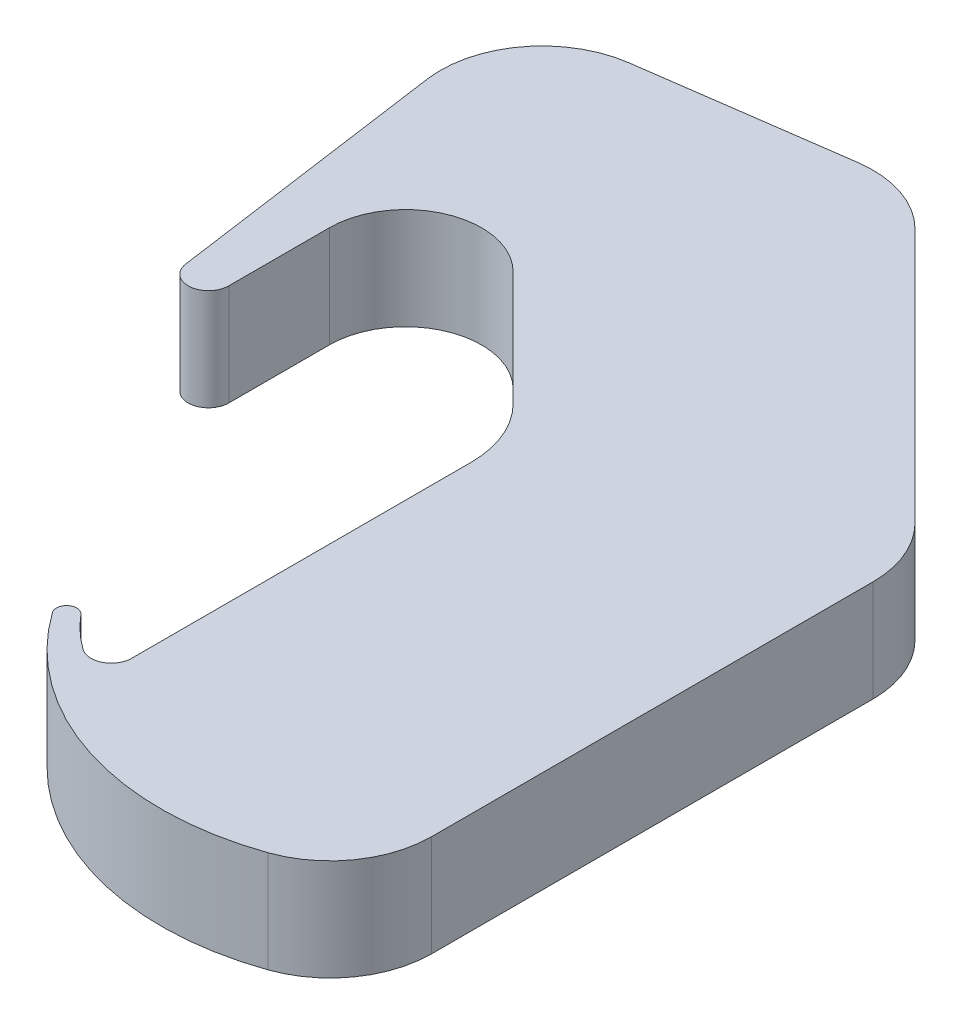
ISO-10303-21;
HEADER;
FILE_DESCRIPTION(('STEP AP214'),'2;1');
FILE_NAME('part.step','',(''),(''),'','','');
FILE_SCHEMA(('AUTOMOTIVE_DESIGN { 1 0 10303 214 1 1 1 1 }'));
ENDSEC;
DATA;
#1=APPLICATION_CONTEXT('core data for automotive mechanical design processes');
#2=APPLICATION_PROTOCOL_DEFINITION('international standard','automotive_design',2000,#1);
#3=PRODUCT_CONTEXT('',#1,'mechanical');
#4=PRODUCT('Part','Part','',(#3));
#5=PRODUCT_RELATED_PRODUCT_CATEGORY('part','',(#4));
#6=PRODUCT_DEFINITION_FORMATION('','',#4);
#7=PRODUCT_DEFINITION_CONTEXT('part definition',#1,'design');
#8=PRODUCT_DEFINITION('design','',#6,#7);
#9=PRODUCT_DEFINITION_SHAPE('','',#8);
#10=(LENGTH_UNIT() NAMED_UNIT(*) SI_UNIT(.MILLI.,.METRE.));
#11=(NAMED_UNIT(*) PLANE_ANGLE_UNIT() SI_UNIT($,.RADIAN.));
#12=(NAMED_UNIT(*) SI_UNIT($,.STERADIAN.) SOLID_ANGLE_UNIT());
#13=UNCERTAINTY_MEASURE_WITH_UNIT(LENGTH_MEASURE(1.E-05),#10,'distance_accuracy_value','');
#14=(GEOMETRIC_REPRESENTATION_CONTEXT(3) GLOBAL_UNCERTAINTY_ASSIGNED_CONTEXT((#13)) GLOBAL_UNIT_ASSIGNED_CONTEXT((#10,
#11,#12)) REPRESENTATION_CONTEXT('',''));
#15=CARTESIAN_POINT('',(0.,0.,0.));
#16=DIRECTION('',(0.,0.,1.));
#17=DIRECTION('',(1.,0.,0.));
#18=AXIS2_PLACEMENT_3D('',#15,#16,#17);
#19=CARTESIAN_POINT('',(3.93125032785003,10.,-3.93125032785006));
#20=DIRECTION('',(-0.707106781186545,0.,0.70710678118655));
#21=DIRECTION('',(0.70710678118655,0.,0.707106781186545));
#22=AXIS2_PLACEMENT_3D('',#19,#20,#21);
#23=PLANE('',#22);
#24=DIRECTION('',(-0.70710678118655,0.,-0.707106781186545));
#25=VECTOR('',#24,1.);
#26=CARTESIAN_POINT('',(3.93125032785003,0.,-3.93125032785006));
#27=LINE('',#26,#25);
#28=CARTESIAN_POINT('',(-28.5248358170459,0.,-36.3873364727457));
#29=VERTEX_POINT('',#28);
#30=CARTESIAN_POINT('',(-53.6653003749161,0.,-61.5278010306157));
#31=VERTEX_POINT('',#30);
#32=EDGE_CURVE('E229',#29,#31,#27,.T.);
#33=ORIENTED_EDGE('',*,*,#32,.T.);
#34=DIRECTION('',(0.,-1.,0.));
#35=VECTOR('',#34,1.);
#36=CARTESIAN_POINT('',(-53.6653003749161,10.,-61.5278010306157));
#37=LINE('',#36,#35);
#38=CARTESIAN_POINT('',(-53.6653003749161,10.,-61.5278010306157));
#39=VERTEX_POINT('',#38);
#40=EDGE_CURVE('E332',#31,#39,#37,.F.);
#41=ORIENTED_EDGE('',*,*,#40,.T.);
#42=DIRECTION('',(-0.70710678118655,0.,-0.707106781186545));
#43=VECTOR('',#42,1.);
#44=CARTESIAN_POINT('',(3.93125032785003,10.,-3.93125032785006));
#45=LINE('',#44,#43);
#46=CARTESIAN_POINT('',(-28.5248358170459,10.,-36.3873364727457));
#47=VERTEX_POINT('',#46);
#48=EDGE_CURVE('E271',#47,#39,#45,.T.);
#49=ORIENTED_EDGE('',*,*,#48,.F.);
#50=DIRECTION('',(0.,-1.,0.));
#51=VECTOR('',#50,1.);
#52=CARTESIAN_POINT('',(-28.5248358170459,0.,-36.3873364727457));
#53=LINE('',#52,#51);
#54=EDGE_CURVE('E328',#47,#29,#53,.T.);
#55=ORIENTED_EDGE('',*,*,#54,.T.);
#56=EDGE_LOOP('',(#33,#41,#49,#55));
#57=FACE_BOUND('',#56,.T.);
#58=ADVANCED_FACE('F41',(#57),#23,.F.);
#59=CARTESIAN_POINT('',(-10.0423160386926,10.,-71.658758244364));
#60=DIRECTION('',(0.138784604687081,0.,0.990322590624818));
#61=DIRECTION('',(0.990322590624818,0.,-0.138784604687081));
#62=AXIS2_PLACEMENT_3D('',#59,#60,#61);
#63=PLANE('',#62);
#64=DIRECTION('',(-0.990322590624818,0.,0.138784604687081));
#65=VECTOR('',#64,1.);
#66=CARTESIAN_POINT('',(-10.0423160386926,0.,-71.658758244364));
#67=LINE('',#66,#65);
#68=CARTESIAN_POINT('',(-62.1242142336523,0.,-64.3599591249984));
#69=VERTEX_POINT('',#68);
#70=CARTESIAN_POINT('',(-81.9471378820217,0.,-61.5819586549239));
#71=VERTEX_POINT('',#70);
#72=EDGE_CURVE('E233',#69,#71,#67,.T.);
#73=ORIENTED_EDGE('',*,*,#72,.T.);
#74=DIRECTION('',(0.,-1.,0.));
#75=VECTOR('',#74,1.);
#76=CARTESIAN_POINT('',(-81.9471378820217,10.,-61.5819586549239));
#77=LINE('',#76,#75);
#78=CARTESIAN_POINT('',(-81.9471378820217,10.,-61.5819586549239));
#79=VERTEX_POINT('',#78);
#80=EDGE_CURVE('E304',#71,#79,#77,.F.);
#81=ORIENTED_EDGE('',*,*,#80,.T.);
#82=DIRECTION('',(-0.990322590624818,0.,0.138784604687081));
#83=VECTOR('',#82,1.);
#84=CARTESIAN_POINT('',(-10.0423160386926,10.,-71.658758244364));
#85=LINE('',#84,#83);
#86=CARTESIAN_POINT('',(-62.1242142336523,10.,-64.3599591249984));
#87=VERTEX_POINT('',#86);
#88=EDGE_CURVE('E179',#87,#79,#85,.T.);
#89=ORIENTED_EDGE('',*,*,#88,.F.);
#90=DIRECTION('',(0.,-1.,0.));
#91=VECTOR('',#90,1.);
#92=CARTESIAN_POINT('',(-62.1242142336523,10.,-64.3599591249984));
#93=LINE('',#92,#91);
#94=EDGE_CURVE('E300',#87,#69,#93,.T.);
#95=ORIENTED_EDGE('',*,*,#94,.T.);
#96=EDGE_LOOP('',(#73,#81,#89,#95));
#97=FACE_BOUND('',#96,.T.);
#98=ADVANCED_FACE('F424',(#97),#63,.F.);
#99=CARTESIAN_POINT('',(-81.8080477495774,10.,11.4646456363109));
#100=DIRECTION('',(0.990322590624818,0.,-0.138784604687081));
#101=DIRECTION('',(-0.138784604687081,0.,-0.990322590624818));
#102=AXIS2_PLACEMENT_3D('',#99,#100,#101);
#103=PLANE('',#102);
#104=DIRECTION('',(0.138784604687081,0.,0.990322590624818));
#105=VECTOR('',#104,1.);
#106=CARTESIAN_POINT('',(-81.8080477495774,10.,11.4646456363109));
#107=LINE('',#106,#105);
#108=CARTESIAN_POINT('',(-90.4625177413991,10.,-50.2908867018049));
#109=VERTEX_POINT('',#108);
#110=CARTESIAN_POINT('',(-86.5765488101609,10.,-22.56185416431));
#111=VERTEX_POINT('',#110);
#112=EDGE_CURVE('E166',#109,#111,#107,.T.);
#113=ORIENTED_EDGE('',*,*,#112,.F.);
#114=DIRECTION('',(0.,-1.,0.));
#115=VECTOR('',#114,1.);
#116=CARTESIAN_POINT('',(-90.4625177413991,10.,-50.2908867018049));
#117=LINE('',#116,#115);
#118=CARTESIAN_POINT('',(-90.4625177413991,0.,-50.2908867018049));
#119=VERTEX_POINT('',#118);
#120=EDGE_CURVE('E189',#109,#119,#117,.T.);
#121=ORIENTED_EDGE('',*,*,#120,.T.);
#122=DIRECTION('',(0.138784604687081,0.,0.990322590624818));
#123=VECTOR('',#122,1.);
#124=CARTESIAN_POINT('',(-81.8080477495774,0.,11.4646456363109));
#125=LINE('',#124,#123);
#126=CARTESIAN_POINT('',(-86.5765488101609,0.,-22.56185416431));
#127=VERTEX_POINT('',#126);
#128=EDGE_CURVE('E185',#119,#127,#125,.T.);
#129=ORIENTED_EDGE('',*,*,#128,.T.);
#130=DIRECTION('',(0.,-1.,0.));
#131=VECTOR('',#130,1.);
#132=CARTESIAN_POINT('',(-86.5765488101609,10.,-22.56185416431));
#133=LINE('',#132,#131);
#134=EDGE_CURVE('E182',#111,#127,#133,.T.);
#135=ORIENTED_EDGE('',*,*,#134,.F.);
#136=EDGE_LOOP('',(#113,#121,#129,#135));
#137=FACE_BOUND('',#136,.T.);
#138=ADVANCED_FACE('F183',(#137),#103,.F.);
#139=CARTESIAN_POINT('',(-84.5959036289112,10.,-22.8394233736842));
#140=DIRECTION('',(0.,-1.,0.));
#141=DIRECTION('',(0.,0.,-1.));
#142=AXIS2_PLACEMENT_3D('',#139,#140,#141);
#143=CYLINDRICAL_SURFACE('',#142,2.);
#144=CARTESIAN_POINT('',(-84.5959036289112,0.,-22.8394233736842));
#145=DIRECTION('',(0.,1.,0.));
#146=DIRECTION('',(0.,0.,1.));
#147=AXIS2_PLACEMENT_3D('',#144,#145,#146);
#148=CIRCLE('',#147,2.);
#149=CARTESIAN_POINT('',(-82.5959036289113,0.,-22.8394233736842));
#150=VERTEX_POINT('',#149);
#151=EDGE_CURVE('E239',#127,#150,#148,.T.);
#152=ORIENTED_EDGE('',*,*,#151,.T.);
#153=DIRECTION('',(0.,-1.,0.));
#154=VECTOR('',#153,1.);
#155=CARTESIAN_POINT('',(-82.5959036289113,10.,-22.8394233736842));
#156=LINE('',#155,#154);
#157=CARTESIAN_POINT('',(-82.5959036289113,10.,-22.8394233736842));
#158=VERTEX_POINT('',#157);
#159=EDGE_CURVE('E190',#158,#150,#156,.T.);
#160=ORIENTED_EDGE('',*,*,#159,.F.);
#161=CARTESIAN_POINT('',(-84.5959036289112,10.,-22.8394233736842));
#162=DIRECTION('',(0.,1.,0.));
#163=DIRECTION('',(0.,0.,1.));
#164=AXIS2_PLACEMENT_3D('',#161,#162,#163);
#165=CIRCLE('',#164,2.);
#166=EDGE_CURVE('E171',#111,#158,#165,.T.);
#167=ORIENTED_EDGE('',*,*,#166,.F.);
#168=ORIENTED_EDGE('',*,*,#134,.T.);
#169=EDGE_LOOP('',(#152,#160,#167,#168));
#170=FACE_BOUND('',#169,.T.);
#171=ADVANCED_FACE('F192',(#170),#143,.T.);
#172=CARTESIAN_POINT('',(-82.5959036289113,10.,0.));
#173=DIRECTION('',(-1.,0.,0.));
#174=DIRECTION('',(0.,0.,1.));
#175=AXIS2_PLACEMENT_3D('',#172,#173,#174);
#176=PLANE('',#175);
#177=DIRECTION('',(0.,0.,-1.));
#178=VECTOR('',#177,1.);
#179=CARTESIAN_POINT('',(-82.5959036289113,0.,0.));
#180=LINE('',#179,#178);
#181=CARTESIAN_POINT('',(-82.5959036289113,0.,-32.7538228203661));
#182=VERTEX_POINT('',#181);
#183=EDGE_CURVE('E242',#150,#182,#180,.T.);
#184=ORIENTED_EDGE('',*,*,#183,.T.);
#185=DIRECTION('',(0.,-1.,0.));
#186=VECTOR('',#185,1.);
#187=CARTESIAN_POINT('',(-82.5959036289113,10.,-32.7538228203661));
#188=LINE('',#187,#186);
#189=CARTESIAN_POINT('',(-82.5959036289113,10.,-32.7538228203661));
#190=VERTEX_POINT('',#189);
#191=EDGE_CURVE('E281',#190,#182,#188,.T.);
#192=ORIENTED_EDGE('',*,*,#191,.F.);
#193=DIRECTION('',(0.,0.,-1.));
#194=VECTOR('',#193,1.);
#195=CARTESIAN_POINT('',(-82.5959036289113,10.,0.));
#196=LINE('',#195,#194);
#197=EDGE_CURVE('E196',#158,#190,#196,.T.);
#198=ORIENTED_EDGE('',*,*,#197,.F.);
#199=ORIENTED_EDGE('',*,*,#159,.T.);
#200=EDGE_LOOP('',(#184,#192,#198,#199));
#201=FACE_BOUND('',#200,.T.);
#202=ADVANCED_FACE('F403',(#201),#176,.F.);
#203=CARTESIAN_POINT('',(-75.0959036289113,10.,-32.7538228203661));
#204=DIRECTION('',(0.,-1.,0.));
#205=DIRECTION('',(0.,0.,-1.));
#206=AXIS2_PLACEMENT_3D('',#203,#204,#205);
#207=CYLINDRICAL_SURFACE('',#206,7.50000000000003);
#208=CARTESIAN_POINT('',(-75.0959036289113,0.,-32.7538228203661));
#209=DIRECTION('',(0.,1.,0.));
#210=DIRECTION('',(0.,0.,1.));
#211=AXIS2_PLACEMENT_3D('',#208,#209,#210);
#212=CIRCLE('',#211,7.50000000000003);
#213=CARTESIAN_POINT('',(-69.7926027700122,0.,-38.0571236792652));
#214=VERTEX_POINT('',#213);
#215=EDGE_CURVE('E246',#214,#182,#212,.T.);
#216=ORIENTED_EDGE('',*,*,#215,.F.);
#217=DIRECTION('',(0.,-1.,0.));
#218=VECTOR('',#217,1.);
#219=CARTESIAN_POINT('',(-69.7926027700122,10.,-38.0571236792652));
#220=LINE('',#219,#218);
#221=CARTESIAN_POINT('',(-69.7926027700122,10.,-38.0571236792652));
#222=VERTEX_POINT('',#221);
#223=EDGE_CURVE('E278',#222,#214,#220,.T.);
#224=ORIENTED_EDGE('',*,*,#223,.F.);
#225=CARTESIAN_POINT('',(-75.0959036289113,10.,-32.7538228203661));
#226=DIRECTION('',(0.,1.,0.));
#227=DIRECTION('',(0.,0.,1.));
#228=AXIS2_PLACEMENT_3D('',#225,#226,#227);
#229=CIRCLE('',#228,7.50000000000003);
#230=EDGE_CURVE('E199',#222,#190,#229,.T.);
#231=ORIENTED_EDGE('',*,*,#230,.T.);
#232=ORIENTED_EDGE('',*,*,#191,.T.);
#233=EDGE_LOOP('',(#216,#224,#231,#232));
#234=FACE_BOUND('',#233,.T.);
#235=ADVANCED_FACE('F410',(#234),#207,.F.);
#236=CARTESIAN_POINT('',(-15.8677395453734,10.,15.8677395453734));
#237=DIRECTION('',(0.707106781186546,0.,-0.707106781186549));
#238=DIRECTION('',(-0.707106781186549,0.,-0.707106781186546));
#239=AXIS2_PLACEMENT_3D('',#236,#237,#238);
#240=PLANE('',#239);
#241=DIRECTION('',(0.707106781186549,0.,0.707106781186546));
#242=VECTOR('',#241,1.);
#243=CARTESIAN_POINT('',(-15.8677395453734,0.,15.8677395453734));
#244=LINE('',#243,#242);
#245=CARTESIAN_POINT('',(-58.5248358170458,0.,-26.7893567262989));
#246=VERTEX_POINT('',#245);
#247=EDGE_CURVE('E250',#214,#246,#244,.T.);
#248=ORIENTED_EDGE('',*,*,#247,.T.);
#249=DIRECTION('',(0.,-1.,0.));
#250=VECTOR('',#249,1.);
#251=CARTESIAN_POINT('',(-58.5248358170458,10.,-26.7893567262989));
#252=LINE('',#251,#250);
#253=CARTESIAN_POINT('',(-58.5248358170458,10.,-26.7893567262989));
#254=VERTEX_POINT('',#253);
#255=EDGE_CURVE('E339',#246,#254,#252,.F.);
#256=ORIENTED_EDGE('',*,*,#255,.T.);
#257=DIRECTION('',(0.707106781186549,0.,0.707106781186546));
#258=VECTOR('',#257,1.);
#259=CARTESIAN_POINT('',(-15.8677395453734,10.,15.8677395453734));
#260=LINE('',#259,#258);
#261=EDGE_CURVE('E206',#222,#254,#260,.T.);
#262=ORIENTED_EDGE('',*,*,#261,.F.);
#263=ORIENTED_EDGE('',*,*,#223,.T.);
#264=EDGE_LOOP('',(#248,#256,#262,#263));
#265=FACE_BOUND('',#264,.T.);
#266=ADVANCED_FACE('F413',(#265),#240,.F.);
#267=CARTESIAN_POINT('',(-55.5959036289113,10.,0.));
#268=DIRECTION('',(1.,0.,0.));
#269=DIRECTION('',(0.,0.,-1.));
#270=AXIS2_PLACEMENT_3D('',#267,#268,#269);
#271=PLANE('',#270);
#272=DIRECTION('',(0.,0.,1.));
#273=VECTOR('',#272,1.);
#274=CARTESIAN_POINT('',(-55.5959036289113,0.,0.));
#275=LINE('',#274,#273);
#276=CARTESIAN_POINT('',(-55.5959036289113,0.,-19.7182889144334));
#277=VERTEX_POINT('',#276);
#278=CARTESIAN_POINT('',(-55.5959036289113,0.,13.7337707016264));
#279=VERTEX_POINT('',#278);
#280=EDGE_CURVE('E254',#277,#279,#275,.T.);
#281=ORIENTED_EDGE('',*,*,#280,.T.);
#282=DIRECTION('',(0.,-1.,0.));
#283=VECTOR('',#282,1.);
#284=CARTESIAN_POINT('',(-55.5959036289113,10.,13.7337707016264));
#285=LINE('',#284,#283);
#286=CARTESIAN_POINT('',(-55.5959036289113,10.,13.7337707016264));
#287=VERTEX_POINT('',#286);
#288=EDGE_CURVE('E63',#279,#287,#285,.F.);
#289=ORIENTED_EDGE('',*,*,#288,.T.);
#290=DIRECTION('',(0.,0.,1.));
#291=VECTOR('',#290,1.);
#292=CARTESIAN_POINT('',(-55.5959036289113,10.,0.));
#293=LINE('',#292,#291);
#294=CARTESIAN_POINT('',(-55.5959036289113,10.,-19.7182889144334));
#295=VERTEX_POINT('',#294);
#296=EDGE_CURVE('E210',#295,#287,#293,.T.);
#297=ORIENTED_EDGE('',*,*,#296,.F.);
#298=DIRECTION('',(0.,-1.,0.));
#299=VECTOR('',#298,1.);
#300=CARTESIAN_POINT('',(-55.5959036289113,0.,-19.7182889144334));
#301=LINE('',#300,#299);
#302=EDGE_CURVE('E335',#295,#277,#301,.T.);
#303=ORIENTED_EDGE('',*,*,#302,.T.);
#304=EDGE_LOOP('',(#281,#289,#297,#303));
#305=FACE_BOUND('',#304,.T.);
#306=ADVANCED_FACE('F418',(#305),#271,.F.);
#307=CARTESIAN_POINT('',(-49.1558895883084,10.,1.98589000818354));
#308=DIRECTION('',(0.,-1.,0.));
#309=DIRECTION('',(0.,0.,-1.));
#310=AXIS2_PLACEMENT_3D('',#307,#308,#309);
#311=CYLINDRICAL_SURFACE('',#310,16.4653564696119);
#312=CARTESIAN_POINT('',(-49.1558895883084,10.,1.98589000818354));
#313=DIRECTION('',(0.,1.,0.));
#314=DIRECTION('',(0.,0.,1.));
#315=AXIS2_PLACEMENT_3D('',#312,#313,#314);
#316=CIRCLE('',#315,16.4653564696119);
#317=CARTESIAN_POINT('',(-61.8263794532103,10.,12.500957780424));
#318=VERTEX_POINT('',#317);
#319=CARTESIAN_POINT('',(-58.7628315312182,10.,15.3580487784401));
#320=VERTEX_POINT('',#319);
#321=EDGE_CURVE('E213',#318,#320,#316,.T.);
#322=ORIENTED_EDGE('',*,*,#321,.T.);
#323=DIRECTION('',(0.,-1.,0.));
#324=VECTOR('',#323,1.);
#325=CARTESIAN_POINT('',(-58.7628315312182,10.,15.3580487784401));
#326=LINE('',#325,#324);
#327=CARTESIAN_POINT('',(-58.7628315312182,0.,15.3580487784401));
#328=VERTEX_POINT('',#327);
#329=EDGE_CURVE('E348',#320,#328,#326,.T.);
#330=ORIENTED_EDGE('',*,*,#329,.T.);
#331=CARTESIAN_POINT('',(-49.1558895883084,0.,1.98589000818354));
#332=DIRECTION('',(0.,1.,0.));
#333=DIRECTION('',(0.,0.,1.));
#334=AXIS2_PLACEMENT_3D('',#331,#332,#333);
#335=CIRCLE('',#334,16.4653564696119);
#336=CARTESIAN_POINT('',(-61.8263794532103,0.,12.500957780424));
#337=VERTEX_POINT('',#336);
#338=EDGE_CURVE('E257',#337,#328,#335,.T.);
#339=ORIENTED_EDGE('',*,*,#338,.F.);
#340=DIRECTION('',(0.,-1.,0.));
#341=VECTOR('',#340,1.);
#342=CARTESIAN_POINT('',(-61.8263794532103,10.,12.500957780424));
#343=LINE('',#342,#341);
#344=EDGE_CURVE('E275',#318,#337,#343,.T.);
#345=ORIENTED_EDGE('',*,*,#344,.F.);
#346=EDGE_LOOP('',(#322,#330,#339,#345));
#347=FACE_BOUND('',#346,.T.);
#348=ADVANCED_FACE('F357',(#347),#311,.F.);
#349=CARTESIAN_POINT('',(-62.5959036289113,10.,13.1395754618356));
#350=DIRECTION('',(0.,-1.,0.));
#351=DIRECTION('',(0.,0.,-1.));
#352=AXIS2_PLACEMENT_3D('',#349,#350,#351);
#353=CYLINDRICAL_SURFACE('',#352,0.999999999999998);
#354=CARTESIAN_POINT('',(-62.5959036289113,0.,13.1395754618356));
#355=DIRECTION('',(0.,1.,0.));
#356=DIRECTION('',(0.,0.,1.));
#357=AXIS2_PLACEMENT_3D('',#354,#355,#356);
#358=CIRCLE('',#357,0.999999999999998);
#359=CARTESIAN_POINT('',(-63.4111830749536,0.,13.7186431822803));
#360=VERTEX_POINT('',#359);
#361=EDGE_CURVE('E260',#337,#360,#358,.T.);
#362=ORIENTED_EDGE('',*,*,#361,.T.);
#363=DIRECTION('',(0.,-1.,0.));
#364=VECTOR('',#363,1.);
#365=CARTESIAN_POINT('',(-63.4111830749536,10.,13.7186431822803));
#366=LINE('',#365,#364);
#367=CARTESIAN_POINT('',(-63.4111830749536,10.,13.7186431822803));
#368=VERTEX_POINT('',#367);
#369=EDGE_CURVE('E228',#368,#360,#366,.T.);
#370=ORIENTED_EDGE('',*,*,#369,.F.);
#371=CARTESIAN_POINT('',(-62.5959036289113,10.,13.1395754618356));
#372=DIRECTION('',(0.,1.,0.));
#373=DIRECTION('',(0.,0.,1.));
#374=AXIS2_PLACEMENT_3D('',#371,#372,#373);
#375=CIRCLE('',#374,0.999999999999998);
#376=EDGE_CURVE('E217',#318,#368,#375,.T.);
#377=ORIENTED_EDGE('',*,*,#376,.F.);
#378=ORIENTED_EDGE('',*,*,#344,.T.);
#379=EDGE_LOOP('',(#362,#370,#377,#378));
#380=FACE_BOUND('',#379,.T.);
#381=ADVANCED_FACE('F366',(#380),#353,.T.);
#382=CARTESIAN_POINT('',(-41.2906382880394,10.,-1.99289414020791));
#383=DIRECTION('',(0.,-1.,0.));
#384=DIRECTION('',(0.,0.,-1.));
#385=AXIS2_PLACEMENT_3D('',#382,#383,#384);
#386=CYLINDRICAL_SURFACE('',#385,27.1324696020436);
#387=CARTESIAN_POINT('',(-41.2906382880394,0.,-1.99289414020791));
#388=DIRECTION('',(0.,1.,0.));
#389=DIRECTION('',(0.,0.,1.));
#390=AXIS2_PLACEMENT_3D('',#387,#388,#389);
#391=CIRCLE('',#390,27.1324696020436);
#392=CARTESIAN_POINT('',(-32.2719609683338,0.,23.5968375135013));
#393=VERTEX_POINT('',#392);
#394=EDGE_CURVE('E263',#360,#393,#391,.T.);
#395=ORIENTED_EDGE('',*,*,#394,.T.);
#396=DIRECTION('',(0.,-1.,0.));
#397=VECTOR('',#396,1.);
#398=CARTESIAN_POINT('',(-32.2719609683338,10.,23.5968375135013));
#399=LINE('',#398,#397);
#400=CARTESIAN_POINT('',(-32.2719609683338,10.,23.5968375135013));
#401=VERTEX_POINT('',#400);
#402=EDGE_CURVE('E325',#393,#401,#399,.F.);
#403=ORIENTED_EDGE('',*,*,#402,.T.);
#404=CARTESIAN_POINT('',(-41.2906382880394,10.,-1.99289414020791));
#405=DIRECTION('',(0.,1.,0.));
#406=DIRECTION('',(0.,0.,1.));
#407=AXIS2_PLACEMENT_3D('',#404,#405,#406);
#408=CIRCLE('',#407,27.1324696020436);
#409=EDGE_CURVE('E220',#368,#401,#408,.T.);
#410=ORIENTED_EDGE('',*,*,#409,.F.);
#411=ORIENTED_EDGE('',*,*,#369,.T.);
#412=EDGE_LOOP('',(#395,#403,#410,#411));
#413=FACE_BOUND('',#412,.T.);
#414=ADVANCED_FACE('F370',(#413),#386,.T.);
#415=CARTESIAN_POINT('',(-25.5959036289113,10.,0.));
#416=DIRECTION('',(1.,0.,0.));
#417=DIRECTION('',(0.,0.,-1.));
#418=AXIS2_PLACEMENT_3D('',#415,#416,#417);
#419=PLANE('',#418);
#420=DIRECTION('',(0.,0.,1.));
#421=VECTOR('',#420,1.);
#422=CARTESIAN_POINT('',(-25.5959036289113,10.,0.));
#423=LINE('',#422,#421);
#424=CARTESIAN_POINT('',(-25.5959036289113,10.,-29.3162686608802));
#425=VERTEX_POINT('',#424);
#426=CARTESIAN_POINT('',(-25.5959036289113,10.,14.1654322529268));
#427=VERTEX_POINT('',#426);
#428=EDGE_CURVE('E224',#425,#427,#423,.T.);
#429=ORIENTED_EDGE('',*,*,#428,.T.);
#430=DIRECTION('',(0.,1.,0.));
#431=VECTOR('',#430,1.);
#432=CARTESIAN_POINT('',(-25.5959036289113,0.,14.1654322529268));
#433=LINE('',#432,#431);
#434=CARTESIAN_POINT('',(-25.5959036289113,0.,14.1654322529268));
#435=VERTEX_POINT('',#434);
#436=EDGE_CURVE('E321',#427,#435,#433,.F.);
#437=ORIENTED_EDGE('',*,*,#436,.T.);
#438=DIRECTION('',(0.,0.,1.));
#439=VECTOR('',#438,1.);
#440=CARTESIAN_POINT('',(-25.5959036289113,0.,0.));
#441=LINE('',#440,#439);
#442=CARTESIAN_POINT('',(-25.5959036289113,0.,-29.3162686608802));
#443=VERTEX_POINT('',#442);
#444=EDGE_CURVE('E267',#443,#435,#441,.T.);
#445=ORIENTED_EDGE('',*,*,#444,.F.);
#446=DIRECTION('',(0.,-1.,0.));
#447=VECTOR('',#446,1.);
#448=CARTESIAN_POINT('',(-25.5959036289113,10.,-29.3162686608802));
#449=LINE('',#448,#447);
#450=EDGE_CURVE('E318',#443,#425,#449,.F.);
#451=ORIENTED_EDGE('',*,*,#450,.T.);
#452=EDGE_LOOP('',(#429,#437,#445,#451));
#453=FACE_BOUND('',#452,.T.);
#454=ADVANCED_FACE('F379',(#453),#419,.T.);
#455=CARTESIAN_POINT('',(0.,10.,0.));
#456=DIRECTION('',(0.,1.,0.));
#457=DIRECTION('',(0.,0.,1.));
#458=AXIS2_PLACEMENT_3D('',#455,#456,#457);
#459=PLANE('',#458);
#460=ORIENTED_EDGE('',*,*,#88,.T.);
#461=CARTESIAN_POINT('',(-80.5592918351509,10.,-51.6787327486757));
#462=DIRECTION('',(0.,1.,0.));
#463=DIRECTION('',(0.,0.,1.));
#464=AXIS2_PLACEMENT_3D('',#461,#462,#463);
#465=CIRCLE('',#464,10.);
#466=EDGE_CURVE('E174',#79,#109,#465,.T.);
#467=ORIENTED_EDGE('',*,*,#466,.T.);
#468=ORIENTED_EDGE('',*,*,#112,.T.);
#469=ORIENTED_EDGE('',*,*,#166,.T.);
#470=ORIENTED_EDGE('',*,*,#197,.T.);
#471=ORIENTED_EDGE('',*,*,#230,.F.);
#472=ORIENTED_EDGE('',*,*,#261,.T.);
#473=CARTESIAN_POINT('',(-65.5959036289113,10.,-19.7182889144334));
#474=DIRECTION('',(0.,1.,0.));
#475=DIRECTION('',(0.,0.,1.));
#476=AXIS2_PLACEMENT_3D('',#473,#474,#475);
#477=CIRCLE('',#476,10.);
#478=EDGE_CURVE('E345',#254,#295,#477,.F.);
#479=ORIENTED_EDGE('',*,*,#478,.T.);
#480=ORIENTED_EDGE('',*,*,#296,.T.);
#481=CARTESIAN_POINT('',(-57.5959036289113,10.,13.7337707016264));
#482=DIRECTION('',(0.,1.,0.));
#483=DIRECTION('',(0.,0.,1.));
#484=AXIS2_PLACEMENT_3D('',#481,#482,#483);
#485=CIRCLE('',#484,2.);
#486=EDGE_CURVE('E11',#287,#320,#485,.F.);
#487=ORIENTED_EDGE('',*,*,#486,.T.);
#488=ORIENTED_EDGE('',*,*,#321,.F.);
#489=ORIENTED_EDGE('',*,*,#376,.T.);
#490=ORIENTED_EDGE('',*,*,#409,.T.);
#491=CARTESIAN_POINT('',(-35.5959036289113,10.,14.1654322529268));
#492=DIRECTION('',(0.,1.,0.));
#493=DIRECTION('',(0.,0.,1.));
#494=AXIS2_PLACEMENT_3D('',#491,#492,#493);
#495=CIRCLE('',#494,10.);
#496=EDGE_CURVE('E313',#401,#427,#495,.T.);
#497=ORIENTED_EDGE('',*,*,#496,.T.);
#498=ORIENTED_EDGE('',*,*,#428,.F.);
#499=CARTESIAN_POINT('',(-35.5959036289113,10.,-29.3162686608802));
#500=DIRECTION('',(0.,1.,0.));
#501=DIRECTION('',(0.,0.,1.));
#502=AXIS2_PLACEMENT_3D('',#499,#500,#501);
#503=CIRCLE('',#502,10.);
#504=EDGE_CURVE('E307',#425,#47,#503,.T.);
#505=ORIENTED_EDGE('',*,*,#504,.T.);
#506=ORIENTED_EDGE('',*,*,#48,.T.);
#507=CARTESIAN_POINT('',(-60.7363681867815,10.,-54.4567332187502));
#508=DIRECTION('',(0.,1.,0.));
#509=DIRECTION('',(0.,0.,1.));
#510=AXIS2_PLACEMENT_3D('',#507,#508,#509);
#511=CIRCLE('',#510,10.);
#512=EDGE_CURVE('E310',#39,#87,#511,.T.);
#513=ORIENTED_EDGE('',*,*,#512,.T.);
#514=EDGE_LOOP('',(#460,#467,#468,#469,#470,#471,#472,#479,#480,#487,#488,#489,#490,#497,#498,
#505,#506,#513));
#515=FACE_BOUND('',#514,.T.);
#516=ADVANCED_FACE('F169',(#515),#459,.T.);
#517=CARTESIAN_POINT('',(0.,0.,0.));
#518=DIRECTION('',(0.,1.,0.));
#519=DIRECTION('',(0.,0.,1.));
#520=AXIS2_PLACEMENT_3D('',#517,#518,#519);
#521=PLANE('',#520);
#522=ORIENTED_EDGE('',*,*,#128,.F.);
#523=CARTESIAN_POINT('',(-80.5592918351509,0.,-51.6787327486757));
#524=DIRECTION('',(0.,1.,0.));
#525=DIRECTION('',(0.,0.,1.));
#526=AXIS2_PLACEMENT_3D('',#523,#524,#525);
#527=CIRCLE('',#526,10.);
#528=EDGE_CURVE('E297',#119,#71,#527,.F.);
#529=ORIENTED_EDGE('',*,*,#528,.T.);
#530=ORIENTED_EDGE('',*,*,#72,.F.);
#531=CARTESIAN_POINT('',(-60.7363681867815,0.,-54.4567332187502));
#532=DIRECTION('',(0.,1.,0.));
#533=DIRECTION('',(0.,0.,1.));
#534=AXIS2_PLACEMENT_3D('',#531,#532,#533);
#535=CIRCLE('',#534,10.);
#536=EDGE_CURVE('E291',#69,#31,#535,.F.);
#537=ORIENTED_EDGE('',*,*,#536,.T.);
#538=ORIENTED_EDGE('',*,*,#32,.F.);
#539=CARTESIAN_POINT('',(-35.5959036289113,0.,-29.3162686608802));
#540=DIRECTION('',(0.,1.,0.));
#541=DIRECTION('',(0.,0.,1.));
#542=AXIS2_PLACEMENT_3D('',#539,#540,#541);
#543=CIRCLE('',#542,10.);
#544=EDGE_CURVE('E288',#29,#443,#543,.F.);
#545=ORIENTED_EDGE('',*,*,#544,.T.);
#546=ORIENTED_EDGE('',*,*,#444,.T.);
#547=CARTESIAN_POINT('',(-35.5959036289113,0.,14.1654322529268));
#548=DIRECTION('',(0.,1.,0.));
#549=DIRECTION('',(0.,0.,1.));
#550=AXIS2_PLACEMENT_3D('',#547,#548,#549);
#551=CIRCLE('',#550,10.);
#552=EDGE_CURVE('E294',#435,#393,#551,.F.);
#553=ORIENTED_EDGE('',*,*,#552,.T.);
#554=ORIENTED_EDGE('',*,*,#394,.F.);
#555=ORIENTED_EDGE('',*,*,#361,.F.);
#556=ORIENTED_EDGE('',*,*,#338,.T.);
#557=CARTESIAN_POINT('',(-57.5959036289113,0.,13.7337707016264));
#558=DIRECTION('',(0.,1.,0.));
#559=DIRECTION('',(0.,0.,1.));
#560=AXIS2_PLACEMENT_3D('',#557,#558,#559);
#561=CIRCLE('',#560,2.);
#562=EDGE_CURVE('E50',#328,#279,#561,.T.);
#563=ORIENTED_EDGE('',*,*,#562,.T.);
#564=ORIENTED_EDGE('',*,*,#280,.F.);
#565=CARTESIAN_POINT('',(-65.5959036289113,0.,-19.7182889144334));
#566=DIRECTION('',(0.,1.,0.));
#567=DIRECTION('',(0.,0.,1.));
#568=AXIS2_PLACEMENT_3D('',#565,#566,#567);
#569=CIRCLE('',#568,10.);
#570=EDGE_CURVE('E342',#277,#246,#569,.T.);
#571=ORIENTED_EDGE('',*,*,#570,.T.);
#572=ORIENTED_EDGE('',*,*,#247,.F.);
#573=ORIENTED_EDGE('',*,*,#215,.T.);
#574=ORIENTED_EDGE('',*,*,#183,.F.);
#575=ORIENTED_EDGE('',*,*,#151,.F.);
#576=EDGE_LOOP('',(#522,#529,#530,#537,#538,#545,#546,#553,#554,#555,#556,#563,#564,#571,#572,
#573,#574,#575));
#577=FACE_BOUND('',#576,.T.);
#578=ADVANCED_FACE('F362',(#577),#521,.F.);
#579=CARTESIAN_POINT('',(-80.5592918351509,10.,-51.6787327486757));
#580=DIRECTION('',(0.,-1.,0.));
#581=DIRECTION('',(0.,0.,-1.));
#582=AXIS2_PLACEMENT_3D('',#579,#580,#581);
#583=CYLINDRICAL_SURFACE('',#582,10.);
#584=ORIENTED_EDGE('',*,*,#466,.F.);
#585=ORIENTED_EDGE('',*,*,#80,.F.);
#586=ORIENTED_EDGE('',*,*,#528,.F.);
#587=ORIENTED_EDGE('',*,*,#120,.F.);
#588=EDGE_LOOP('',(#584,#585,#586,#587));
#589=FACE_BOUND('',#588,.T.);
#590=ADVANCED_FACE('F399',(#589),#583,.T.);
#591=CARTESIAN_POINT('',(-35.5959036289113,10.,14.1654322529268));
#592=DIRECTION('',(0.,-1.,0.));
#593=DIRECTION('',(0.,0.,-1.));
#594=AXIS2_PLACEMENT_3D('',#591,#592,#593);
#595=CYLINDRICAL_SURFACE('',#594,10.);
#596=ORIENTED_EDGE('',*,*,#496,.F.);
#597=ORIENTED_EDGE('',*,*,#402,.F.);
#598=ORIENTED_EDGE('',*,*,#552,.F.);
#599=ORIENTED_EDGE('',*,*,#436,.F.);
#600=EDGE_LOOP('',(#596,#597,#598,#599));
#601=FACE_BOUND('',#600,.T.);
#602=ADVANCED_FACE('F376',(#601),#595,.T.);
#603=CARTESIAN_POINT('',(-60.7363681867815,10.,-54.4567332187502));
#604=DIRECTION('',(0.,-1.,0.));
#605=DIRECTION('',(0.,0.,-1.));
#606=AXIS2_PLACEMENT_3D('',#603,#604,#605);
#607=CYLINDRICAL_SURFACE('',#606,10.);
#608=ORIENTED_EDGE('',*,*,#512,.F.);
#609=ORIENTED_EDGE('',*,*,#40,.F.);
#610=ORIENTED_EDGE('',*,*,#536,.F.);
#611=ORIENTED_EDGE('',*,*,#94,.F.);
#612=EDGE_LOOP('',(#608,#609,#610,#611));
#613=FACE_BOUND('',#612,.T.);
#614=ADVANCED_FACE('F436',(#613),#607,.T.);
#615=CARTESIAN_POINT('',(-35.5959036289113,10.,-29.3162686608802));
#616=DIRECTION('',(0.,1.,0.));
#617=DIRECTION('',(0.,0.,1.));
#618=AXIS2_PLACEMENT_3D('',#615,#616,#617);
#619=CYLINDRICAL_SURFACE('',#618,10.);
#620=ORIENTED_EDGE('',*,*,#504,.F.);
#621=ORIENTED_EDGE('',*,*,#450,.F.);
#622=ORIENTED_EDGE('',*,*,#544,.F.);
#623=ORIENTED_EDGE('',*,*,#54,.F.);
#624=EDGE_LOOP('',(#620,#621,#622,#623));
#625=FACE_BOUND('',#624,.T.);
#626=ADVANCED_FACE('F385',(#625),#619,.T.);
#627=CARTESIAN_POINT('',(-65.5959036289113,10.,-19.7182889144334));
#628=DIRECTION('',(0.,1.,0.));
#629=DIRECTION('',(0.,0.,1.));
#630=AXIS2_PLACEMENT_3D('',#627,#628,#629);
#631=CYLINDRICAL_SURFACE('',#630,10.);
#632=ORIENTED_EDGE('',*,*,#478,.F.);
#633=ORIENTED_EDGE('',*,*,#255,.F.);
#634=ORIENTED_EDGE('',*,*,#570,.F.);
#635=ORIENTED_EDGE('',*,*,#302,.F.);
#636=EDGE_LOOP('',(#632,#633,#634,#635));
#637=FACE_BOUND('',#636,.T.);
#638=ADVANCED_FACE('F416',(#637),#631,.F.);
#639=CARTESIAN_POINT('',(-57.5959036289113,10.,13.7337707016264));
#640=DIRECTION('',(0.,-1.,0.));
#641=DIRECTION('',(0.,0.,-1.));
#642=AXIS2_PLACEMENT_3D('',#639,#640,#641);
#643=CYLINDRICAL_SURFACE('',#642,2.);
#644=ORIENTED_EDGE('',*,*,#486,.F.);
#645=ORIENTED_EDGE('',*,*,#288,.F.);
#646=ORIENTED_EDGE('',*,*,#562,.F.);
#647=ORIENTED_EDGE('',*,*,#329,.F.);
#648=EDGE_LOOP('',(#644,#645,#646,#647));
#649=FACE_BOUND('',#648,.T.);
#650=ADVANCED_FACE('F43',(#649),#643,.F.);
#651=CLOSED_SHELL('',(#58,#98,#138,#171,#202,#235,#266,#306,#348,#381,#414,#454,#516,#578,#590,
#602,#614,#626,#638,#650));
#652=MANIFOLD_SOLID_BREP('B2',#651);
#653=ADVANCED_BREP_SHAPE_REPRESENTATION('',(#18,#652),#14);
#654=SHAPE_DEFINITION_REPRESENTATION(#9,#653);
ENDSEC;
END-ISO-10303-21;
